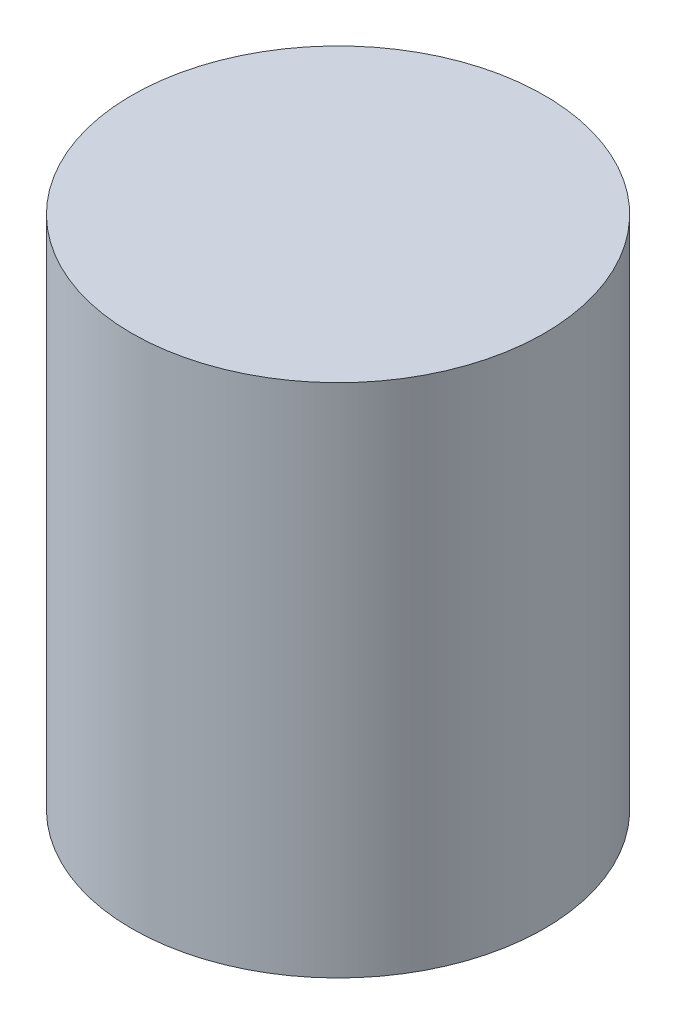
ISO-10303-21;
HEADER;
FILE_DESCRIPTION(('STEP AP214'),'2;1');
FILE_NAME('part.step','',(''),(''),'','','');
FILE_SCHEMA(('AUTOMOTIVE_DESIGN { 1 0 10303 214 1 1 1 1 }'));
ENDSEC;
DATA;
#1=APPLICATION_CONTEXT('core data for automotive mechanical design processes');
#2=APPLICATION_PROTOCOL_DEFINITION('international standard','automotive_design',2000,#1);
#3=PRODUCT_CONTEXT('',#1,'mechanical');
#4=PRODUCT('Part','Part','',(#3));
#5=PRODUCT_RELATED_PRODUCT_CATEGORY('part','',(#4));
#6=PRODUCT_DEFINITION_FORMATION('','',#4);
#7=PRODUCT_DEFINITION_CONTEXT('part definition',#1,'design');
#8=PRODUCT_DEFINITION('design','',#6,#7);
#9=PRODUCT_DEFINITION_SHAPE('','',#8);
#10=(LENGTH_UNIT() NAMED_UNIT(*) SI_UNIT(.MILLI.,.METRE.));
#11=(NAMED_UNIT(*) PLANE_ANGLE_UNIT() SI_UNIT($,.RADIAN.));
#12=(NAMED_UNIT(*) SI_UNIT($,.STERADIAN.) SOLID_ANGLE_UNIT());
#13=UNCERTAINTY_MEASURE_WITH_UNIT(LENGTH_MEASURE(1.E-05),#10,'distance_accuracy_value','');
#14=(GEOMETRIC_REPRESENTATION_CONTEXT(3) GLOBAL_UNCERTAINTY_ASSIGNED_CONTEXT((#13)) GLOBAL_UNIT_ASSIGNED_CONTEXT((#10,
#11,#12)) REPRESENTATION_CONTEXT('',''));
#15=CARTESIAN_POINT('',(0.,0.,0.));
#16=DIRECTION('',(0.,0.,1.));
#17=DIRECTION('',(1.,0.,0.));
#18=AXIS2_PLACEMENT_3D('',#15,#16,#17);
#19=CARTESIAN_POINT('',(0.,50.,0.));
#20=DIRECTION('',(0.,-1.,0.));
#21=DIRECTION('',(0.,0.,-1.));
#22=AXIS2_PLACEMENT_3D('',#19,#20,#21);
#23=CYLINDRICAL_SURFACE('',#22,20.);
#24=CARTESIAN_POINT('',(0.,50.,0.));
#25=DIRECTION('',(0.,1.,0.));
#26=DIRECTION('',(0.,0.,1.));
#27=AXIS2_PLACEMENT_3D('',#24,#25,#26);
#28=CIRCLE('',#27,20.);
#29=CARTESIAN_POINT('',(0.,50.,20.));
#30=VERTEX_POINT('',#29);
#31=EDGE_CURVE('E10',#30,#30,#28,.T.);
#32=ORIENTED_EDGE('',*,*,#31,.F.);
#33=EDGE_LOOP('',(#32));
#34=FACE_BOUND('',#33,.T.);
#35=CARTESIAN_POINT('',(0.,0.,0.));
#36=DIRECTION('',(0.,1.,0.));
#37=DIRECTION('',(0.,0.,1.));
#38=AXIS2_PLACEMENT_3D('',#35,#36,#37);
#39=CIRCLE('',#38,20.);
#40=CARTESIAN_POINT('',(0.,0.,20.));
#41=VERTEX_POINT('',#40);
#42=EDGE_CURVE('E44',#41,#41,#39,.T.);
#43=ORIENTED_EDGE('',*,*,#42,.T.);
#44=EDGE_LOOP('',(#43));
#45=FACE_BOUND('',#44,.T.);
#46=ADVANCED_FACE('F41',(#34,#45),#23,.T.);
#47=CARTESIAN_POINT('',(0.,50.,0.));
#48=DIRECTION('',(0.,1.,0.));
#49=DIRECTION('',(0.,0.,1.));
#50=AXIS2_PLACEMENT_3D('',#47,#48,#49);
#51=PLANE('',#50);
#52=ORIENTED_EDGE('',*,*,#31,.T.);
#53=EDGE_LOOP('',(#52));
#54=FACE_BOUND('',#53,.T.);
#55=ADVANCED_FACE('F58',(#54),#51,.T.);
#56=CARTESIAN_POINT('',(0.,0.,0.));
#57=DIRECTION('',(0.,1.,0.));
#58=DIRECTION('',(0.,0.,1.));
#59=AXIS2_PLACEMENT_3D('',#56,#57,#58);
#60=PLANE('',#59);
#61=ORIENTED_EDGE('',*,*,#42,.F.);
#62=EDGE_LOOP('',(#61));
#63=FACE_BOUND('',#62,.T.);
#64=ADVANCED_FACE('F56',(#63),#60,.F.);
#65=CLOSED_SHELL('',(#46,#55,#64));
#66=MANIFOLD_SOLID_BREP('B2',#65);
#67=ADVANCED_BREP_SHAPE_REPRESENTATION('',(#18,#66),#14);
#68=SHAPE_DEFINITION_REPRESENTATION(#9,#67);
ENDSEC;
END-ISO-10303-21;
